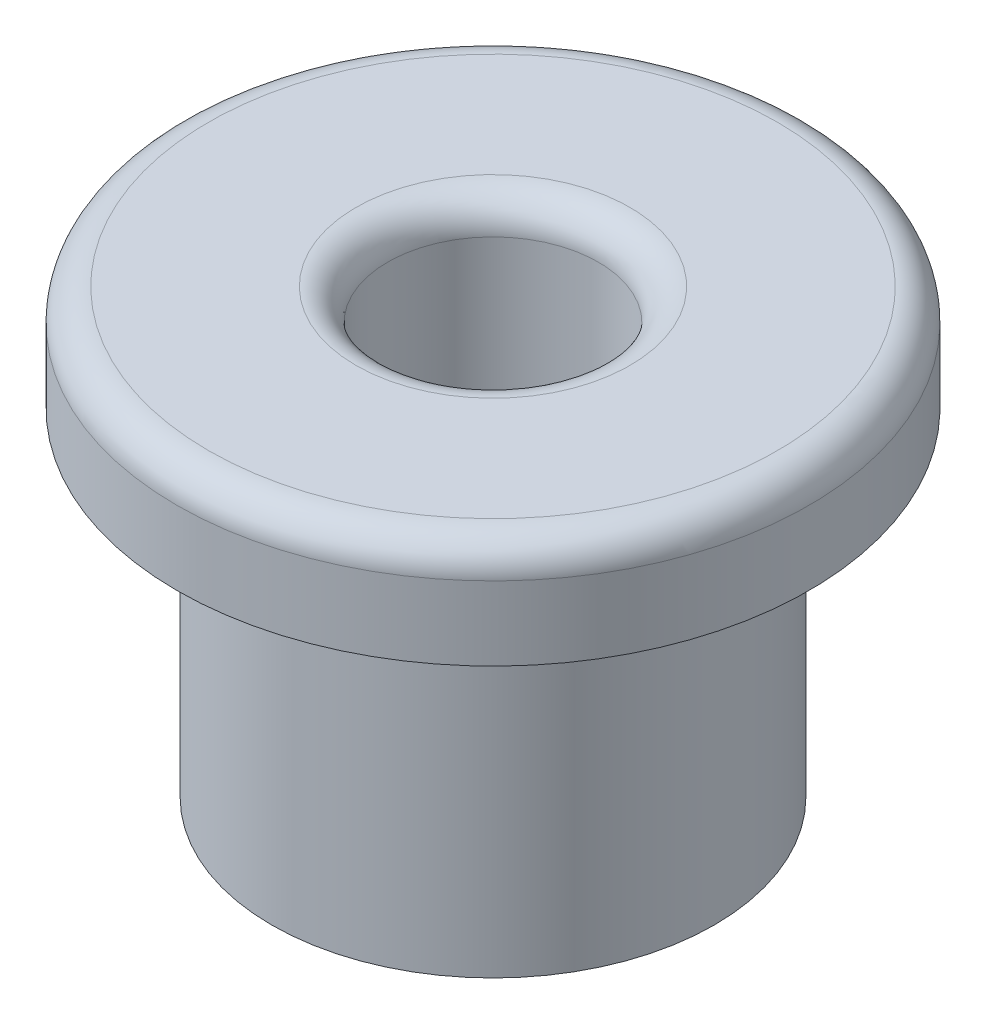
ISO-10303-21;
HEADER;
FILE_DESCRIPTION(('STEP AP214'),'2;1');
FILE_NAME('part.step','',(''),(''),'','','');
FILE_SCHEMA(('AUTOMOTIVE_DESIGN { 1 0 10303 214 1 1 1 1 }'));
ENDSEC;
DATA;
#1=APPLICATION_CONTEXT('core data for automotive mechanical design processes');
#2=APPLICATION_PROTOCOL_DEFINITION('international standard','automotive_design',2000,#1);
#3=PRODUCT_CONTEXT('',#1,'mechanical');
#4=PRODUCT('Part','Part','',(#3));
#5=PRODUCT_RELATED_PRODUCT_CATEGORY('part','',(#4));
#6=PRODUCT_DEFINITION_FORMATION('','',#4);
#7=PRODUCT_DEFINITION_CONTEXT('part definition',#1,'design');
#8=PRODUCT_DEFINITION('design','',#6,#7);
#9=PRODUCT_DEFINITION_SHAPE('','',#8);
#10=(LENGTH_UNIT() NAMED_UNIT(*) SI_UNIT(.MILLI.,.METRE.));
#11=(NAMED_UNIT(*) PLANE_ANGLE_UNIT() SI_UNIT($,.RADIAN.));
#12=(NAMED_UNIT(*) SI_UNIT($,.STERADIAN.) SOLID_ANGLE_UNIT());
#13=UNCERTAINTY_MEASURE_WITH_UNIT(LENGTH_MEASURE(1.E-05),#10,'distance_accuracy_value','');
#14=(GEOMETRIC_REPRESENTATION_CONTEXT(3) GLOBAL_UNCERTAINTY_ASSIGNED_CONTEXT((#13)) GLOBAL_UNIT_ASSIGNED_CONTEXT((#10,
#11,#12)) REPRESENTATION_CONTEXT('',''));
#15=CARTESIAN_POINT('',(0.,0.,0.));
#16=DIRECTION('',(0.,0.,1.));
#17=DIRECTION('',(1.,0.,0.));
#18=AXIS2_PLACEMENT_3D('',#15,#16,#17);
#19=CARTESIAN_POINT('',(0.,4.2,0.));
#20=DIRECTION('',(0.,-1.,0.));
#21=DIRECTION('',(0.,0.,-1.));
#22=AXIS2_PLACEMENT_3D('',#19,#20,#21);
#23=CYLINDRICAL_SURFACE('',#22,2.1);
#24=CARTESIAN_POINT('',(0.,0.,0.));
#25=DIRECTION('',(0.,1.,0.));
#26=DIRECTION('',(0.,0.,1.));
#27=AXIS2_PLACEMENT_3D('',#24,#25,#26);
#28=CIRCLE('',#27,2.1);
#29=CARTESIAN_POINT('',(0.,0.,2.1));
#30=VERTEX_POINT('',#29);
#31=EDGE_CURVE('E56',#30,#30,#28,.T.);
#32=ORIENTED_EDGE('',*,*,#31,.T.);
#33=EDGE_LOOP('',(#32));
#34=FACE_BOUND('',#33,.T.);
#35=CARTESIAN_POINT('',(0.,3.2,0.));
#36=DIRECTION('',(0.,1.,0.));
#37=DIRECTION('',(0.,0.,1.));
#38=AXIS2_PLACEMENT_3D('',#35,#36,#37);
#39=CIRCLE('',#38,2.1);
#40=CARTESIAN_POINT('',(0.,3.2,2.1));
#41=VERTEX_POINT('',#40);
#42=EDGE_CURVE('E53',#41,#41,#39,.T.);
#43=ORIENTED_EDGE('',*,*,#42,.F.);
#44=EDGE_LOOP('',(#43));
#45=FACE_BOUND('',#44,.T.);
#46=ADVANCED_FACE('F33',(#34,#45),#23,.T.);
#47=CARTESIAN_POINT('',(0.,4.2,0.));
#48=DIRECTION('',(0.,-1.,0.));
#49=DIRECTION('',(0.,0.,-1.));
#50=AXIS2_PLACEMENT_3D('',#47,#48,#49);
#51=CYLINDRICAL_SURFACE('',#50,1.);
#52=CARTESIAN_POINT('',(0.,3.9,0.));
#53=DIRECTION('',(0.,1.,0.));
#54=DIRECTION('',(0.,0.,1.));
#55=AXIS2_PLACEMENT_3D('',#52,#53,#54);
#56=CIRCLE('',#55,1.);
#57=CARTESIAN_POINT('',(0.,3.9,1.));
#58=VERTEX_POINT('',#57);
#59=EDGE_CURVE('E10',#58,#58,#56,.T.);
#60=ORIENTED_EDGE('',*,*,#59,.T.);
#61=EDGE_LOOP('',(#60));
#62=FACE_BOUND('',#61,.T.);
#63=CARTESIAN_POINT('',(0.,0.,0.));
#64=DIRECTION('',(0.,1.,0.));
#65=DIRECTION('',(0.,0.,1.));
#66=AXIS2_PLACEMENT_3D('',#63,#64,#65);
#67=CIRCLE('',#66,1.);
#68=CARTESIAN_POINT('',(0.,0.,1.));
#69=VERTEX_POINT('',#68);
#70=EDGE_CURVE('E59',#69,#69,#67,.T.);
#71=ORIENTED_EDGE('',*,*,#70,.F.);
#72=EDGE_LOOP('',(#71));
#73=FACE_BOUND('',#72,.T.);
#74=ADVANCED_FACE('F81',(#62,#73),#51,.F.);
#75=CARTESIAN_POINT('',(0.,4.2,0.));
#76=DIRECTION('',(0.,1.,0.));
#77=DIRECTION('',(0.,0.,1.));
#78=AXIS2_PLACEMENT_3D('',#75,#76,#77);
#79=PLANE('',#78);
#80=CARTESIAN_POINT('',(0.,4.2,0.));
#81=DIRECTION('',(0.,1.,0.));
#82=DIRECTION('',(0.,0.,1.));
#83=AXIS2_PLACEMENT_3D('',#80,#81,#82);
#84=CIRCLE('',#83,2.7);
#85=CARTESIAN_POINT('',(0.,4.2,2.7));
#86=VERTEX_POINT('',#85);
#87=EDGE_CURVE('E44',#86,#86,#84,.T.);
#88=ORIENTED_EDGE('',*,*,#87,.T.);
#89=EDGE_LOOP('',(#88));
#90=FACE_BOUND('',#89,.T.);
#91=CARTESIAN_POINT('',(0.,4.2,0.));
#92=DIRECTION('',(0.,1.,0.));
#93=DIRECTION('',(0.,0.,1.));
#94=AXIS2_PLACEMENT_3D('',#91,#92,#93);
#95=CIRCLE('',#94,1.3);
#96=CARTESIAN_POINT('',(0.,4.2,1.3));
#97=VERTEX_POINT('',#96);
#98=EDGE_CURVE('E48',#97,#97,#95,.F.);
#99=ORIENTED_EDGE('',*,*,#98,.T.);
#100=EDGE_LOOP('',(#99));
#101=FACE_BOUND('',#100,.T.);
#102=ADVANCED_FACE('F87',(#90,#101),#79,.T.);
#103=CARTESIAN_POINT('',(0.,0.,0.));
#104=DIRECTION('',(0.,1.,0.));
#105=DIRECTION('',(0.,0.,1.));
#106=AXIS2_PLACEMENT_3D('',#103,#104,#105);
#107=PLANE('',#106);
#108=ORIENTED_EDGE('',*,*,#70,.T.);
#109=EDGE_LOOP('',(#108));
#110=FACE_BOUND('',#109,.T.);
#111=ORIENTED_EDGE('',*,*,#31,.F.);
#112=EDGE_LOOP('',(#111));
#113=FACE_BOUND('',#112,.T.);
#114=ADVANCED_FACE('F78',(#110,#113),#107,.F.);
#115=CARTESIAN_POINT('',(0.,3.2,0.));
#116=DIRECTION('',(0.,1.,0.));
#117=DIRECTION('',(0.,0.,1.));
#118=AXIS2_PLACEMENT_3D('',#115,#116,#117);
#119=CYLINDRICAL_SURFACE('',#118,3.);
#120=CARTESIAN_POINT('',(0.,3.9,0.));
#121=DIRECTION('',(0.,1.,0.));
#122=DIRECTION('',(0.,0.,1.));
#123=AXIS2_PLACEMENT_3D('',#120,#121,#122);
#124=CIRCLE('',#123,3.);
#125=CARTESIAN_POINT('',(0.,3.9,3.));
#126=VERTEX_POINT('',#125);
#127=EDGE_CURVE('E40',#126,#126,#124,.F.);
#128=ORIENTED_EDGE('',*,*,#127,.T.);
#129=EDGE_LOOP('',(#128));
#130=FACE_BOUND('',#129,.T.);
#131=CARTESIAN_POINT('',(0.,3.2,0.));
#132=DIRECTION('',(0.,1.,0.));
#133=DIRECTION('',(0.,0.,1.));
#134=AXIS2_PLACEMENT_3D('',#131,#132,#133);
#135=CIRCLE('',#134,3.);
#136=CARTESIAN_POINT('',(0.,3.2,3.));
#137=VERTEX_POINT('',#136);
#138=EDGE_CURVE('E62',#137,#137,#135,.T.);
#139=ORIENTED_EDGE('',*,*,#138,.T.);
#140=EDGE_LOOP('',(#139));
#141=FACE_BOUND('',#140,.T.);
#142=ADVANCED_FACE('F66',(#130,#141),#119,.T.);
#143=CARTESIAN_POINT('',(0.,3.2,0.));
#144=DIRECTION('',(0.,1.,0.));
#145=DIRECTION('',(0.,0.,1.));
#146=AXIS2_PLACEMENT_3D('',#143,#144,#145);
#147=PLANE('',#146);
#148=ORIENTED_EDGE('',*,*,#42,.T.);
#149=EDGE_LOOP('',(#148));
#150=FACE_BOUND('',#149,.T.);
#151=ORIENTED_EDGE('',*,*,#138,.F.);
#152=EDGE_LOOP('',(#151));
#153=FACE_BOUND('',#152,.T.);
#154=ADVANCED_FACE('F68',(#150,#153),#147,.F.);
#155=CARTESIAN_POINT('',(0.,3.9,0.));
#156=DIRECTION('',(0.,1.,0.));
#157=DIRECTION('',(0.,0.,1.));
#158=AXIS2_PLACEMENT_3D('',#155,#156,#157);
#159=TOROIDAL_SURFACE('',#158,2.7,0.3);
#160=ORIENTED_EDGE('',*,*,#127,.F.);
#161=EDGE_LOOP('',(#160));
#162=FACE_BOUND('',#161,.T.);
#163=ORIENTED_EDGE('',*,*,#87,.F.);
#164=EDGE_LOOP('',(#163));
#165=FACE_BOUND('',#164,.T.);
#166=ADVANCED_FACE('F70',(#162,#165),#159,.T.);
#167=CARTESIAN_POINT('',(0.,3.9,0.));
#168=DIRECTION('',(0.,1.,0.));
#169=DIRECTION('',(0.,0.,1.));
#170=AXIS2_PLACEMENT_3D('',#167,#168,#169);
#171=TOROIDAL_SURFACE('',#170,1.3,0.3);
#172=ORIENTED_EDGE('',*,*,#98,.F.);
#173=EDGE_LOOP('',(#172));
#174=FACE_BOUND('',#173,.T.);
#175=ORIENTED_EDGE('',*,*,#59,.F.);
#176=EDGE_LOOP('',(#175));
#177=FACE_BOUND('',#176,.T.);
#178=ADVANCED_FACE('F35',(#174,#177),#171,.T.);
#179=CLOSED_SHELL('',(#46,#74,#102,#114,#142,#154,#166,#178));
#180=MANIFOLD_SOLID_BREP('B2',#179);
#181=ADVANCED_BREP_SHAPE_REPRESENTATION('',(#18,#180),#14);
#182=SHAPE_DEFINITION_REPRESENTATION(#9,#181);
ENDSEC;
END-ISO-10303-21;
